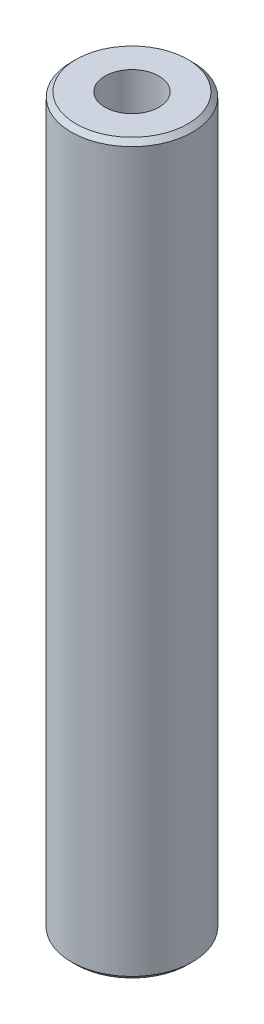
ISO-10303-21;
HEADER;
FILE_DESCRIPTION(('STEP AP214'),'2;1');
FILE_NAME('part.step','',(''),(''),'','','');
FILE_SCHEMA(('AUTOMOTIVE_DESIGN { 1 0 10303 214 1 1 1 1 }'));
ENDSEC;
DATA;
#1=APPLICATION_CONTEXT('core data for automotive mechanical design processes');
#2=APPLICATION_PROTOCOL_DEFINITION('international standard','automotive_design',2000,#1);
#3=PRODUCT_CONTEXT('',#1,'mechanical');
#4=PRODUCT('Part','Part','',(#3));
#5=PRODUCT_RELATED_PRODUCT_CATEGORY('part','',(#4));
#6=PRODUCT_DEFINITION_FORMATION('','',#4);
#7=PRODUCT_DEFINITION_CONTEXT('part definition',#1,'design');
#8=PRODUCT_DEFINITION('design','',#6,#7);
#9=PRODUCT_DEFINITION_SHAPE('','',#8);
#10=(LENGTH_UNIT() NAMED_UNIT(*) SI_UNIT(.MILLI.,.METRE.));
#11=(NAMED_UNIT(*) PLANE_ANGLE_UNIT() SI_UNIT($,.RADIAN.));
#12=(NAMED_UNIT(*) SI_UNIT($,.STERADIAN.) SOLID_ANGLE_UNIT());
#13=UNCERTAINTY_MEASURE_WITH_UNIT(LENGTH_MEASURE(1.E-05),#10,'distance_accuracy_value','');
#14=(GEOMETRIC_REPRESENTATION_CONTEXT(3) GLOBAL_UNCERTAINTY_ASSIGNED_CONTEXT((#13)) GLOBAL_UNIT_ASSIGNED_CONTEXT((#10,
#11,#12)) REPRESENTATION_CONTEXT('',''));
#15=CARTESIAN_POINT('',(0.,0.,0.));
#16=DIRECTION('',(0.,0.,1.));
#17=DIRECTION('',(1.,0.,0.));
#18=AXIS2_PLACEMENT_3D('',#15,#16,#17);
#19=CARTESIAN_POINT('',(0.,600.,0.));
#20=DIRECTION('',(0.,-1.,0.));
#21=DIRECTION('',(0.,0.,-1.));
#22=AXIS2_PLACEMENT_3D('',#19,#20,#21);
#23=CYLINDRICAL_SURFACE('',#22,50.);
#24=CARTESIAN_POINT('',(0.,596.065779166887,0.));
#25=DIRECTION('',(0.,1.,0.));
#26=DIRECTION('',(0.,0.,1.));
#27=AXIS2_PLACEMENT_3D('',#24,#25,#26);
#28=CIRCLE('',#27,50.);
#29=CARTESIAN_POINT('',(0.,596.065779166887,50.));
#30=VERTEX_POINT('',#29);
#31=EDGE_CURVE('E50',#30,#30,#28,.F.);
#32=ORIENTED_EDGE('',*,*,#31,.T.);
#33=EDGE_LOOP('',(#32));
#34=FACE_BOUND('',#33,.T.);
#35=CARTESIAN_POINT('',(0.,3.9342208331129,0.));
#36=DIRECTION('',(0.,1.,0.));
#37=DIRECTION('',(0.,0.,1.));
#38=AXIS2_PLACEMENT_3D('',#35,#36,#37);
#39=CIRCLE('',#38,50.);
#40=CARTESIAN_POINT('',(0.,3.9342208331129,50.));
#41=VERTEX_POINT('',#40);
#42=EDGE_CURVE('E51',#41,#41,#39,.T.);
#43=ORIENTED_EDGE('',*,*,#42,.T.);
#44=EDGE_LOOP('',(#43));
#45=FACE_BOUND('',#44,.T.);
#46=ADVANCED_FACE('F39',(#34,#45),#23,.T.);
#47=CARTESIAN_POINT('',(0.,600.,0.));
#48=DIRECTION('',(0.,1.,0.));
#49=DIRECTION('',(0.,0.,1.));
#50=AXIS2_PLACEMENT_3D('',#47,#48,#49);
#51=PLANE('',#50);
#52=CARTESIAN_POINT('',(0.,600.,0.));
#53=DIRECTION('',(0.,1.,0.));
#54=DIRECTION('',(0.,0.,1.));
#55=AXIS2_PLACEMENT_3D('',#52,#53,#54);
#56=CIRCLE('',#55,46.0657791668869);
#57=CARTESIAN_POINT('',(0.,600.,46.0657791668869));
#58=VERTEX_POINT('',#57);
#59=EDGE_CURVE('E54',#58,#58,#56,.T.);
#60=ORIENTED_EDGE('',*,*,#59,.T.);
#61=EDGE_LOOP('',(#60));
#62=FACE_BOUND('',#61,.T.);
#63=CARTESIAN_POINT('',(0.,600.,0.));
#64=DIRECTION('',(0.,1.,0.));
#65=DIRECTION('',(0.,0.,1.));
#66=AXIS2_PLACEMENT_3D('',#63,#64,#65);
#67=CIRCLE('',#66,22.2616163684541);
#68=CARTESIAN_POINT('',(0.,600.,22.2616163684541));
#69=VERTEX_POINT('',#68);
#70=EDGE_CURVE('E58',#69,#69,#67,.T.);
#71=ORIENTED_EDGE('',*,*,#70,.F.);
#72=EDGE_LOOP('',(#71));
#73=FACE_BOUND('',#72,.T.);
#74=ADVANCED_FACE('F69',(#62,#73),#51,.T.);
#75=CARTESIAN_POINT('',(0.,0.,0.));
#76=DIRECTION('',(0.,1.,0.));
#77=DIRECTION('',(0.,0.,1.));
#78=AXIS2_PLACEMENT_3D('',#75,#76,#77);
#79=PLANE('',#78);
#80=CARTESIAN_POINT('',(0.,0.,0.));
#81=DIRECTION('',(0.,1.,0.));
#82=DIRECTION('',(0.,0.,1.));
#83=AXIS2_PLACEMENT_3D('',#80,#81,#82);
#84=CIRCLE('',#83,46.065779166887);
#85=CARTESIAN_POINT('',(0.,0.,46.065779166887));
#86=VERTEX_POINT('',#85);
#87=EDGE_CURVE('E10',#86,#86,#84,.F.);
#88=ORIENTED_EDGE('',*,*,#87,.T.);
#89=EDGE_LOOP('',(#88));
#90=FACE_BOUND('',#89,.T.);
#91=CARTESIAN_POINT('',(0.,0.,0.));
#92=DIRECTION('',(0.,1.,0.));
#93=DIRECTION('',(0.,0.,1.));
#94=AXIS2_PLACEMENT_3D('',#91,#92,#93);
#95=CIRCLE('',#94,22.2616163684541);
#96=CARTESIAN_POINT('',(0.,0.,22.2616163684541));
#97=VERTEX_POINT('',#96);
#98=EDGE_CURVE('E63',#97,#97,#95,.T.);
#99=ORIENTED_EDGE('',*,*,#98,.T.);
#100=EDGE_LOOP('',(#99));
#101=FACE_BOUND('',#100,.T.);
#102=ADVANCED_FACE('F75',(#90,#101),#79,.F.);
#103=CARTESIAN_POINT('',(0.,600.,0.));
#104=DIRECTION('',(0.,-1.,0.));
#105=DIRECTION('',(0.,0.,-1.));
#106=AXIS2_PLACEMENT_3D('',#103,#104,#105);
#107=CYLINDRICAL_SURFACE('',#106,22.2616163684541);
#108=ORIENTED_EDGE('',*,*,#70,.T.);
#109=EDGE_LOOP('',(#108));
#110=FACE_BOUND('',#109,.T.);
#111=ORIENTED_EDGE('',*,*,#98,.F.);
#112=EDGE_LOOP('',(#111));
#113=FACE_BOUND('',#112,.T.);
#114=ADVANCED_FACE('F70',(#110,#113),#107,.F.);
#115=CARTESIAN_POINT('',(0.,600.,0.));
#116=DIRECTION('',(0.,-1.,0.));
#117=DIRECTION('',(0.,0.,-1.));
#118=AXIS2_PLACEMENT_3D('',#115,#116,#117);
#119=CONICAL_SURFACE('',#118,46.0657791668869,0.785398163397451);
#120=ORIENTED_EDGE('',*,*,#31,.F.);
#121=EDGE_LOOP('',(#120));
#122=FACE_BOUND('',#121,.T.);
#123=ORIENTED_EDGE('',*,*,#59,.F.);
#124=EDGE_LOOP('',(#123));
#125=FACE_BOUND('',#124,.T.);
#126=ADVANCED_FACE('F81',(#122,#125),#119,.T.);
#127=CARTESIAN_POINT('',(0.,3.9342208331129,0.));
#128=DIRECTION('',(0.,1.,0.));
#129=DIRECTION('',(0.,0.,1.));
#130=AXIS2_PLACEMENT_3D('',#127,#128,#129);
#131=CONICAL_SURFACE('',#130,50.,0.785398163397463);
#132=ORIENTED_EDGE('',*,*,#87,.F.);
#133=EDGE_LOOP('',(#132));
#134=FACE_BOUND('',#133,.T.);
#135=ORIENTED_EDGE('',*,*,#42,.F.);
#136=EDGE_LOOP('',(#135));
#137=FACE_BOUND('',#136,.T.);
#138=ADVANCED_FACE('F45',(#134,#137),#131,.T.);
#139=CLOSED_SHELL('',(#46,#74,#102,#114,#126,#138));
#140=MANIFOLD_SOLID_BREP('B2',#139);
#141=ADVANCED_BREP_SHAPE_REPRESENTATION('',(#18,#140),#14);
#142=SHAPE_DEFINITION_REPRESENTATION(#9,#141);
ENDSEC;
END-ISO-10303-21;
